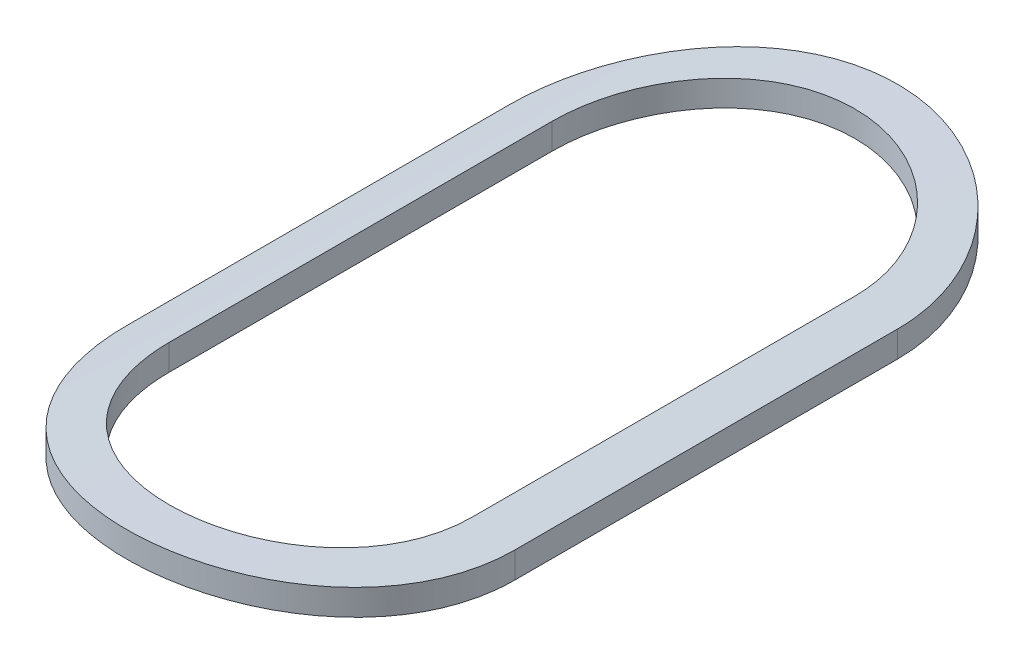
ISO-10303-21;
HEADER;
FILE_DESCRIPTION(('STEP AP214'),'2;1');
FILE_NAME('part.step','',(''),(''),'','','');
FILE_SCHEMA(('AUTOMOTIVE_DESIGN { 1 0 10303 214 1 1 1 1 }'));
ENDSEC;
DATA;
#1=APPLICATION_CONTEXT('core data for automotive mechanical design processes');
#2=APPLICATION_PROTOCOL_DEFINITION('international standard','automotive_design',2000,#1);
#3=PRODUCT_CONTEXT('',#1,'mechanical');
#4=PRODUCT('Part','Part','',(#3));
#5=PRODUCT_RELATED_PRODUCT_CATEGORY('part','',(#4));
#6=PRODUCT_DEFINITION_FORMATION('','',#4);
#7=PRODUCT_DEFINITION_CONTEXT('part definition',#1,'design');
#8=PRODUCT_DEFINITION('design','',#6,#7);
#9=PRODUCT_DEFINITION_SHAPE('','',#8);
#10=(LENGTH_UNIT() NAMED_UNIT(*) SI_UNIT(.MILLI.,.METRE.));
#11=(NAMED_UNIT(*) PLANE_ANGLE_UNIT() SI_UNIT($,.RADIAN.));
#12=(NAMED_UNIT(*) SI_UNIT($,.STERADIAN.) SOLID_ANGLE_UNIT());
#13=UNCERTAINTY_MEASURE_WITH_UNIT(LENGTH_MEASURE(1.E-05),#10,'distance_accuracy_value','');
#14=(GEOMETRIC_REPRESENTATION_CONTEXT(3) GLOBAL_UNCERTAINTY_ASSIGNED_CONTEXT((#13)) GLOBAL_UNIT_ASSIGNED_CONTEXT((#10,
#11,#12)) REPRESENTATION_CONTEXT('',''));
#15=CARTESIAN_POINT('',(0.,0.,0.));
#16=DIRECTION('',(0.,0.,1.));
#17=DIRECTION('',(1.,0.,0.));
#18=AXIS2_PLACEMENT_3D('',#15,#16,#17);
#19=CARTESIAN_POINT('',(-175.2707109821,-62.9180736437962,1.42682282483733));
#20=DIRECTION('',(0.,0.,1.));
#21=DIRECTION('',(1.,0.,0.));
#22=AXIS2_PLACEMENT_3D('',#19,#20,#21);
#23=CYLINDRICAL_SURFACE('',#22,5.);
#24=CARTESIAN_POINT('',(-174.562352977331,-57.9685050830951,5.32081992476383));
#25=CARTESIAN_POINT('',(-174.56231819202,-57.9685236249811,5.36045875118211));
#26=CARTESIAN_POINT('',(-174.565677996493,-57.9680294147791,5.40008292658635));
#27=CARTESIAN_POINT('',(-174.578924725972,-57.9661536270468,5.47815846697256));
#28=CARTESIAN_POINT('',(-174.588804133438,-57.9647730715818,5.51661112942715));
#29=CARTESIAN_POINT('',(-174.614832857679,-57.9612616354489,5.59130719884207));
#30=CARTESIAN_POINT('',(-174.630983979941,-57.9591305387334,5.62754996614363));
#31=CARTESIAN_POINT('',(-174.669077247436,-57.9543647067663,5.6968107435006));
#32=CARTESIAN_POINT('',(-174.691019134295,-57.9517299939866,5.72982889734269));
#33=CARTESIAN_POINT('',(-174.740238549183,-57.9462315808067,5.79193570801099));
#34=CARTESIAN_POINT('',(-174.767548783778,-57.9433665437921,5.82099833037868));
#35=CARTESIAN_POINT('',(-174.826661618482,-57.9377423080896,5.87414733717646));
#36=CARTESIAN_POINT('',(-174.85846490313,-57.9349831256107,5.89823296195574));
#37=CARTESIAN_POINT('',(-174.925826905015,-57.9298676599313,5.94083672096562));
#38=CARTESIAN_POINT('',(-174.961401017461,-57.9275131399999,5.95933074329454));
#39=CARTESIAN_POINT('',(-175.035187231282,-57.9234873673329,5.99007073367095));
#40=CARTESIAN_POINT('',(-175.073399053675,-57.9218160424669,6.0023173613399));
#41=CARTESIAN_POINT('',(-175.151106693764,-57.9193542972137,6.02013689817473));
#42=CARTESIAN_POINT('',(-175.190592212742,-57.9185580590577,6.02575390124891));
#43=CARTESIAN_POINT('',(-175.269953800404,-57.9179162798542,6.03029159454107));
#44=CARTESIAN_POINT('',(-175.309829858972,-57.9180707142472,6.0292124577464));
#45=CARTESIAN_POINT('',(-175.388537942688,-57.9193082454885,6.02042324927953));
#46=CARTESIAN_POINT('',(-175.427375404778,-57.9203846735061,6.01276079389282));
#47=CARTESIAN_POINT('',(-175.503207413134,-57.9233377917456,5.9910971297904));
#48=CARTESIAN_POINT('',(-175.540201926849,-57.9252144960958,5.97709580916644));
#49=CARTESIAN_POINT('',(-175.611444068649,-57.9295688237723,5.94310217437232));
#50=CARTESIAN_POINT('',(-175.64568185491,-57.9320484831862,5.92308950574412));
#51=CARTESIAN_POINT('',(-175.710329754601,-57.9373318406017,5.87765687959288));
#52=CARTESIAN_POINT('',(-175.740739797455,-57.940135544576,5.85223682239281));
#53=CARTESIAN_POINT('',(-175.797147093776,-57.9457827135758,5.79644921190762));
#54=CARTESIAN_POINT('',(-175.823103896636,-57.9486263127461,5.76604076055394));
#55=CARTESIAN_POINT('',(-175.86955966979,-57.9540098748137,5.70126671262856));
#56=CARTESIAN_POINT('',(-175.890057044511,-57.956549748825,5.66689996339814));
#57=CARTESIAN_POINT('',(-175.925016265224,-57.9610385580672,5.59514016548326));
#58=CARTESIAN_POINT('',(-175.939470709579,-57.9629867678087,5.55774347210164));
#59=CARTESIAN_POINT('',(-175.961861656507,-57.9660598482316,5.48104617640926));
#60=CARTESIAN_POINT('',(-175.969807944731,-57.9671859547476,5.4417485269542));
#61=CARTESIAN_POINT('',(-175.975949994197,-57.9680595995502,5.38860509983583));
#62=CARTESIAN_POINT('',(-175.977120148638,-57.9682265264067,5.37506300564641));
#63=CARTESIAN_POINT('',(-175.978678608053,-57.9684491444339,5.34795585093716));
#64=CARTESIAN_POINT('',(-175.979068226181,-57.9685050224289,5.33439086748172));
#65=CARTESIAN_POINT('',(-175.979068986851,-57.9685050830926,5.32081992476383));
#66=B_SPLINE_CURVE_WITH_KNOTS('',3,(#24,#25,#26,#27,#28,#29,#30,#31,#32,#33,#34,#35,#36,#37,#38,
#39,#40,#41,#42,#43,#44,#45,#46,#47,#48,#49,#50,#51,#52,#53,#54,#55,#56,#57,#58,#59,#60,#61,#62,
#63,#64,#65),.UNSPECIFIED.,.F.,.F.,(4,2,2,2,2,2,2,2,2,2,2,2,2,2,2,2,2,2,2,2,4),(0.,
0.118749475652929,0.237362263855814,0.35600922337358,0.474650889962778,0.594039129072952,
0.713445577251891,0.833359813547281,0.953261386262471,1.07236091244366,1.19145736183339,
1.30969958496656,1.42794389566529,1.54659318409006,1.66524465982466,1.78492258189405,
1.90463544277968,2.02449450646763,2.14417301772139,2.18493687446289,2.22563209338629),.UNSPECIFIED.);
#67=CARTESIAN_POINT('',(-174.562352977331,-57.9685050830952,5.32081992476383));
#68=VERTEX_POINT('',#67);
#69=CARTESIAN_POINT('',(-175.97906898685,-57.9685050830925,5.32081992476383));
#70=VERTEX_POINT('',#69);
#71=EDGE_CURVE('E173',#68,#70,#66,.T.);
#72=ORIENTED_EDGE('',*,*,#71,.T.);
#73=DIRECTION('',(0.,0.,-1.));
#74=VECTOR('',#73,1.);
#75=CARTESIAN_POINT('',(-175.97906898685,-57.9685050830925,3.52987704480571));
#76=LINE('',#75,#74);
#77=CARTESIAN_POINT('',(-175.97906898685,-57.9685050830925,3.52987704480571));
#78=VERTEX_POINT('',#77);
#79=EDGE_CURVE('E111',#78,#70,#76,.F.);
#80=ORIENTED_EDGE('',*,*,#79,.F.);
#81=CARTESIAN_POINT('',(-175.979068986851,-57.9685050830926,3.52987704480571));
#82=CARTESIAN_POINT('',(-175.979103777404,-57.9685236247256,3.49023832453203));
#83=CARTESIAN_POINT('',(-175.975743988307,-57.9680294172962,3.45061425502311));
#84=CARTESIAN_POINT('',(-175.962497288361,-57.9661536344881,3.37253870868179));
#85=CARTESIAN_POINT('',(-175.952617860228,-57.9647730764401,3.33408594039167));
#86=CARTESIAN_POINT('',(-175.926588842244,-57.9612615989126,3.25938899672188));
#87=CARTESIAN_POINT('',(-175.910437333816,-57.9591304498519,3.22314550106915));
#88=CARTESIAN_POINT('',(-175.872343784117,-57.9543645974187,3.15388484997989));
#89=CARTESIAN_POINT('',(-175.850402241076,-57.9517299373784,3.1208674172773));
#90=CARTESIAN_POINT('',(-175.801186207544,-57.9462318835382,3.05876469671131));
#91=CARTESIAN_POINT('',(-175.773879481096,-57.9433671722798,3.02970507030447));
#92=CARTESIAN_POINT('',(-175.714767073951,-57.9377429193244,2.97655491580578));
#93=CARTESIAN_POINT('',(-175.682959722483,-57.9349834171696,2.95246624128657));
#94=CARTESIAN_POINT('',(-175.61557800544,-57.9298662750012,2.90984890980619));
#95=CARTESIAN_POINT('',(-175.57998670533,-57.9275105763355,2.89134680394253));
#96=CARTESIAN_POINT('',(-175.506189605935,-57.923485599968,2.86061259257313));
#97=CARTESIAN_POINT('',(-175.467986932545,-57.921815517783,2.848373134471));
#98=CARTESIAN_POINT('',(-175.403100424651,-57.9197589158793,2.83349071746206));
#99=CARTESIAN_POINT('',(-175.376831481638,-57.9191299886342,2.82900786755081));
#100=CARTESIAN_POINT('',(-175.323949145474,-57.9182871387536,2.82302143781594));
#101=CARTESIAN_POINT('',(-175.297335748446,-57.9180732207935,2.82151789155697));
#102=CARTESIAN_POINT('',(-175.231136540235,-57.9180742725377,2.82152074713413));
#103=CARTESIAN_POINT('',(-175.191536979936,-57.9185484483598,2.82484680154105));
#104=CARTESIAN_POINT('',(-175.113441958173,-57.9203944948015,2.83806121489374));
#105=CARTESIAN_POINT('',(-175.074947692914,-57.9217673023731,2.84795642327372));
#106=CARTESIAN_POINT('',(-175.000206768985,-57.9252561689578,2.87400886775347));
#107=CARTESIAN_POINT('',(-174.963958442602,-57.9273716685142,2.8901613912734));
#108=CARTESIAN_POINT('',(-174.894692643812,-57.9321116511946,2.92825947150864));
#109=CARTESIAN_POINT('',(-174.861674706968,-57.9347360609899,2.95020419379137));
#110=CARTESIAN_POINT('',(-174.799570750716,-57.9402220719574,2.99942664621899));
#111=CARTESIAN_POINT('',(-174.770510524656,-57.9430850497233,3.02673676787916));
#112=CARTESIAN_POINT('',(-174.717367995549,-57.9487147875814,3.08584760976759));
#113=CARTESIAN_POINT('',(-174.693286163217,-57.9514815385547,3.11764875415212));
#114=CARTESIAN_POINT('',(-174.650681520965,-57.9566194521663,3.1850138370231));
#115=CARTESIAN_POINT('',(-174.632184900153,-57.9589887286847,3.22059447628956));
#116=CARTESIAN_POINT('',(-174.601448246041,-57.9630429435685,3.29439116564335));
#117=CARTESIAN_POINT('',(-174.589204586684,-57.9647282784311,3.33260567373838));
#118=CARTESIAN_POINT('',(-174.574318473495,-57.9668037408559,3.39751872626201));
#119=CARTESIAN_POINT('',(-174.569835226755,-57.9674384398504,3.42380208033444));
#120=CARTESIAN_POINT('',(-174.563852293327,-57.9682904852838,3.47667870746521));
#121=CARTESIAN_POINT('',(-174.562348809687,-57.9685083628436,3.50327154262443));
#122=CARTESIAN_POINT('',(-174.562352977331,-57.9685050830951,3.5298770448057));
#123=B_SPLINE_CURVE_WITH_KNOTS('',3,(#81,#82,#83,#84,#85,#86,#87,#88,#89,#90,#91,#92,#93,#94,
#95,#96,#97,#98,#99,#100,#101,#102,#103,#104,#105,#106,#107,#108,#109,#110,#111,#112,#113,#114,
#115,#116,#117,#118,#119,#120,#121,#122),.UNSPECIFIED.,.F.,.F.,(4,2,2,2,2,2,2,2,2,2,2,2,2,2,2,2,
2,2,2,2,4),(0.,0.118749159033299,0.237362263863262,0.356011680082915,0.474650889915929,
0.594026017222667,0.713445577112572,0.833424074530637,0.953261387365867,1.03306921841364,
1.11287794856634,1.23150381401027,1.35025356129366,1.46891404775443,1.58755744913422,
1.70694043541029,1.82633470440586,1.94628041824212,2.06615649703429,2.14600710616939,
2.22575590036766),.UNSPECIFIED.);
#124=CARTESIAN_POINT('',(-174.562352977331,-57.9685050830952,3.52987704480571));
#125=VERTEX_POINT('',#124);
#126=EDGE_CURVE('E118',#78,#125,#123,.T.);
#127=ORIENTED_EDGE('',*,*,#126,.T.);
#128=DIRECTION('',(0.,0.,1.));
#129=VECTOR('',#128,1.);
#130=CARTESIAN_POINT('',(-174.562352977331,-57.9685050830952,5.32081992476383));
#131=LINE('',#130,#129);
#132=EDGE_CURVE('E115',#68,#125,#131,.F.);
#133=ORIENTED_EDGE('',*,*,#132,.F.);
#134=EDGE_LOOP('',(#72,#80,#127,#133));
#135=FACE_BOUND('',#134,.T.);
#136=DIRECTION('',(0.,0.,-1.));
#137=VECTOR('',#136,1.);
#138=CARTESIAN_POINT('',(-174.362352977331,-58.0012773560523,3.52987696078578));
#139=LINE('',#138,#137);
#140=CARTESIAN_POINT('',(-174.362352977331,-58.0012773560523,3.52987696078578));
#141=VERTEX_POINT('',#140);
#142=CARTESIAN_POINT('',(-174.362352977331,-58.0012773560523,5.32081994286791));
#143=VERTEX_POINT('',#142);
#144=EDGE_CURVE('E98',#141,#143,#139,.F.);
#145=ORIENTED_EDGE('',*,*,#144,.F.);
#146=CARTESIAN_POINT('',(-176.179068986851,-58.0012773560489,3.52987708101368));
#147=CARTESIAN_POINT('',(-176.179114366647,-58.0013080368418,3.4792219297534));
#148=CARTESIAN_POINT('',(-176.174834712648,-58.000495368357,3.42858937675781));
#149=CARTESIAN_POINT('',(-176.157971730428,-57.9974131802428,3.32884240625041));
#150=CARTESIAN_POINT('',(-176.145400169869,-57.995145725333,3.27972594040186));
#151=CARTESIAN_POINT('',(-176.112294829344,-57.9893820577137,3.18432358231991));
#152=CARTESIAN_POINT('',(-176.091759530645,-57.9858856106396,3.138038231948));
#153=CARTESIAN_POINT('',(-176.043341300228,-57.9780690294218,3.04956636986069));
#154=CARTESIAN_POINT('',(-176.015458277593,-57.9737488850862,3.00737990887206));
#155=CARTESIAN_POINT('',(-175.952792460442,-57.9647138412302,2.92782227610408));
#156=CARTESIAN_POINT('',(-175.917941755172,-57.9599953436674,2.89050499879237));
#157=CARTESIAN_POINT('',(-175.842463605392,-57.9507260347656,2.82220174991102));
#158=CARTESIAN_POINT('',(-175.801834045646,-57.9461752855989,2.79121810680912));
#159=CARTESIAN_POINT('',(-175.715588232075,-57.9377147972196,2.73625643735128));
#160=CARTESIAN_POINT('',(-175.669936683177,-57.9338101507921,2.71233300379545));
#161=CARTESIAN_POINT('',(-175.575213179916,-57.9271295165128,2.67254075741945));
#162=CARTESIAN_POINT('',(-175.526145342003,-57.9243521969489,2.65666243536377));
#163=CARTESIAN_POINT('',(-175.4424669164,-57.9209105999476,2.63723571162568));
#164=CARTESIAN_POINT('',(-175.40839653215,-57.9198519863191,2.63135099754461));
#165=CARTESIAN_POINT('',(-175.339792609163,-57.9184331630702,2.62349190486007));
#166=CARTESIAN_POINT('',(-175.30525906848,-57.9180729563864,2.62151754269873));
#167=CARTESIAN_POINT('',(-175.220141009846,-57.9180746499965,2.62152123179757));
#168=CARTESIAN_POINT('',(-175.169539872234,-57.9188489013581,2.62575686441778));
#169=CARTESIAN_POINT('',(-175.069756594041,-57.9218634183327,2.64257956007804));
#170=CARTESIAN_POINT('',(-175.020575948302,-57.9241051734904,2.65517510877496));
#171=CARTESIAN_POINT('',(-174.925099240572,-57.9298035985899,2.68832059626614));
#172=CARTESIAN_POINT('',(-174.878800496785,-57.9332591185302,2.70886300753467));
#173=CARTESIAN_POINT('',(-174.790312394406,-57.9410069772031,2.7572995596663));
#174=CARTESIAN_POINT('',(-174.748122604101,-57.9452992278809,2.7851929270472));
#175=CARTESIAN_POINT('',(-174.668569162746,-57.9543002591481,2.84787293478168));
#176=CARTESIAN_POINT('',(-174.631258464305,-57.9590128033068,2.88272624567159));
#177=CARTESIAN_POINT('',(-174.562978557937,-57.968295362933,2.95819652195916));
#178=CARTESIAN_POINT('',(-174.532010050101,-57.9728653626182,2.99881412281832));
#179=CARTESIAN_POINT('',(-174.477071165942,-57.9813827188733,3.08503574409306));
#180=CARTESIAN_POINT('',(-174.453156151766,-57.9853250434699,3.13067554180307));
#181=CARTESIAN_POINT('',(-174.413364405679,-57.9920847349784,3.22540082224826));
#182=CARTESIAN_POINT('',(-174.397482636797,-57.9949028065798,3.27448412381041));
#183=CARTESIAN_POINT('',(-174.378056703226,-57.998395644865,3.35818881487485));
#184=CARTESIAN_POINT('',(-174.372173997171,-57.9994703023625,3.39226913660031));
#185=CARTESIAN_POINT('',(-174.364321265333,-58.0009136885917,3.46085325862075));
#186=CARTESIAN_POINT('',(-174.36234686283,-58.0012832069578,3.49535654162629));
#187=CARTESIAN_POINT('',(-174.362352977331,-58.0012773560522,3.52987696078577));
#188=B_SPLINE_CURVE_WITH_KNOTS('',3,(#146,#147,#148,#149,#150,#151,#152,#153,#154,#155,#156,
#157,#158,#159,#160,#161,#162,#163,#164,#165,#166,#167,#168,#169,#170,#171,#172,#173,#174,#175,
#176,#177,#178,#179,#180,#181,#182,#183,#184,#185,#186,#187),.UNSPECIFIED.,.F.,.F.,(4,2,2,2,2,2,
2,2,2,2,2,2,2,2,2,2,2,2,2,2,4),(0.,0.151744406498762,0.303273923270082,0.454832351871486,
0.6063926558806,0.759509268653378,0.912682071666717,1.06700998168233,1.22115504971323,
1.32471214644135,1.42826967860242,1.57985264815249,1.73158971640642,1.88318340494268,
2.03476114885404,2.18786728699564,2.34099031685206,2.49528502654272,2.64948287072658,
2.75306909479241,2.85653925190756),.UNSPECIFIED.);
#189=CARTESIAN_POINT('',(-176.17906898685,-58.0012773560488,3.5298770629097));
#190=VERTEX_POINT('',#189);
#191=EDGE_CURVE('E21',#190,#141,#188,.T.);
#192=ORIENTED_EDGE('',*,*,#191,.F.);
#193=DIRECTION('',(0.,0.,1.));
#194=VECTOR('',#193,1.);
#195=CARTESIAN_POINT('',(-176.17906898685,-58.0012773560488,5.32082006024206));
#196=LINE('',#195,#194);
#197=CARTESIAN_POINT('',(-176.17906898685,-58.0012773560489,5.32082006024206));
#198=VERTEX_POINT('',#197);
#199=EDGE_CURVE('E85',#198,#190,#196,.F.);
#200=ORIENTED_EDGE('',*,*,#199,.F.);
#201=CARTESIAN_POINT('',(-174.362352977331,-58.0012773560522,5.32081999718015));
#202=CARTESIAN_POINT('',(-174.362307610228,-58.0013080360505,5.37147525422055));
#203=CARTESIAN_POINT('',(-174.366587284845,-58.0004953628914,5.42210791225333));
#204=CARTESIAN_POINT('',(-174.383450306933,-57.9974131663501,5.52185487520521));
#205=CARTESIAN_POINT('',(-174.396021852251,-57.9951457137386,5.57097123447137));
#206=CARTESIAN_POINT('',(-174.42912685624,-57.9893821077238,5.66637254599697));
#207=CARTESIAN_POINT('',(-174.449661692882,-57.9858857416783,5.71265700661743));
#208=CARTESIAN_POINT('',(-174.498079590673,-57.9780691912071,5.80112901604925));
#209=CARTESIAN_POINT('',(-174.525963033067,-57.9737489640427,5.84331635214712));
#210=CARTESIAN_POINT('',(-174.588633036654,-57.9647133472899,5.92287905630114));
#211=CARTESIAN_POINT('',(-174.623488098071,-57.9599943286363,5.96020006542393));
#212=CARTESIAN_POINT('',(-174.698966779969,-57.9507250466619,6.02850188445801));
#213=CARTESIAN_POINT('',(-174.739591286672,-57.9461748094026,6.05948171853836));
#214=CARTESIAN_POINT('',(-174.825812375784,-57.9377170390507,6.11442620809822));
#215=CARTESIAN_POINT('',(-174.87144229385,-57.9338143117028,6.13833935533354));
#216=CARTESIAN_POINT('',(-174.966151942711,-57.9271323998905,6.17813887124257));
#217=CARTESIAN_POINT('',(-175.015231213887,-57.9243530660682,6.19402630702382));
#218=CARTESIAN_POINT('',(-175.114880505209,-57.9202565918597,6.21715621127686));
#219=CARTESIAN_POINT('',(-175.165428418801,-57.9189238293954,6.22449110746085));
#220=CARTESIAN_POINT('',(-175.267055002908,-57.9178168560988,6.23059558530492));
#221=CARTESIAN_POINT('',(-175.318133643187,-57.9180425569635,6.22936565225134));
#222=CARTESIAN_POINT('',(-175.418735850112,-57.9200148838634,6.21844630187917));
#223=CARTESIAN_POINT('',(-175.468270643492,-57.9217435791224,6.2088566131761));
#224=CARTESIAN_POINT('',(-175.565015772011,-57.9265075655432,6.18164755950147));
#225=CARTESIAN_POINT('',(-175.612226042043,-57.9295428932801,6.16402796975671));
#226=CARTESIAN_POINT('',(-175.703274511403,-57.9366092879403,6.1211627525986));
#227=CARTESIAN_POINT('',(-175.74709328936,-57.9406456025222,6.09587677358439));
#228=CARTESIAN_POINT('',(-175.829901605459,-57.9492667840127,6.03842705843372));
#229=CARTESIAN_POINT('',(-175.868890850454,-57.9538516841867,6.0062629051228));
#230=CARTESIAN_POINT('',(-175.9415208449,-57.9631391168093,5.93542411214913));
#231=CARTESIAN_POINT('',(-175.975077241772,-57.9678423940488,5.89666303959368));
#232=CARTESIAN_POINT('',(-176.03523420761,-57.9767749976083,5.81400475123458));
#233=CARTESIAN_POINT('',(-176.061832821042,-57.9810041904932,5.77010609648485));
#234=CARTESIAN_POINT('',(-176.107341494261,-57.9885113367211,5.67830469992557));
#235=CARTESIAN_POINT('',(-176.126235445796,-57.9917872930662,5.63039381905504));
#236=CARTESIAN_POINT('',(-176.155655935524,-57.9969864261021,5.53203705199008));
#237=CARTESIAN_POINT('',(-176.166194958724,-57.9989116207771,5.48159506849547));
#238=CARTESIAN_POINT('',(-176.174624694251,-58.0004580940873,5.41243742288703));
#239=CARTESIAN_POINT('',(-176.176291948775,-58.0007650160899,5.39413886799977));
#240=CARTESIAN_POINT('',(-176.178512665097,-58.0011744553454,5.35750293230471));
#241=CARTESIAN_POINT('',(-176.179067998095,-58.0012773160009,5.33916566879907));
#242=CARTESIAN_POINT('',(-176.179068986851,-58.0012773560489,5.32082006024206));
#243=B_SPLINE_CURVE_WITH_KNOTS('',3,(#201,#202,#203,#204,#205,#206,#207,#208,#209,#210,#211,
#212,#213,#214,#215,#216,#217,#218,#219,#220,#221,#222,#223,#224,#225,#226,#227,#228,#229,#230,
#231,#232,#233,#234,#235,#236,#237,#238,#239,#240,#241,#242),.UNSPECIFIED.,.F.,.F.,(4,2,2,2,2,2,
2,2,2,2,2,2,2,2,2,2,2,2,2,2,4),(0.,0.151744722104373,0.303273924606038,0.454829359511642,
0.606392658633337,0.759525593615995,0.912682076236851,1.06692882079774,1.22115505113774,
1.37369863297175,1.52623357170144,1.67697335211144,1.82771735229264,1.97926898039392,
2.13082980300057,2.28455551072837,2.43832437782105,2.59241310359364,2.74627113391338,
2.80137542981597,2.85638691513428),.UNSPECIFIED.);
#244=EDGE_CURVE('E99',#143,#198,#243,.T.);
#245=ORIENTED_EDGE('',*,*,#244,.F.);
#246=EDGE_LOOP('',(#145,#192,#200,#245));
#247=FACE_BOUND('',#246,.T.);
#248=ADVANCED_FACE('F17',(#135,#247),#23,.T.);
#249=CARTESIAN_POINT('',(-174.362352977331,-67.7980736437962,3.52987696078578));
#250=DIRECTION('',(1.,0.,0.));
#251=DIRECTION('',(0.,0.,-1.));
#252=AXIS2_PLACEMENT_3D('',#249,#250,#251);
#253=PLANE('',#252);
#254=ORIENTED_EDGE('',*,*,#144,.T.);
#255=DIRECTION('',(0.,-1.,0.));
#256=VECTOR('',#255,1.);
#257=CARTESIAN_POINT('',(-174.362352977331,-67.7980736437962,5.32081996097199));
#258=LINE('',#257,#256);
#259=CARTESIAN_POINT('',(-174.362352977331,-58.1233592899298,5.32081994286791));
#260=VERTEX_POINT('',#259);
#261=EDGE_CURVE('E168',#260,#143,#258,.F.);
#262=ORIENTED_EDGE('',*,*,#261,.F.);
#263=DIRECTION('',(0.,0.,1.));
#264=VECTOR('',#263,1.);
#265=CARTESIAN_POINT('',(-174.362352977331,-58.1233592899298,1.42682282483733));
#266=LINE('',#265,#264);
#267=CARTESIAN_POINT('',(-174.362352977331,-58.1233592899298,3.52987696078578));
#268=VERTEX_POINT('',#267);
#269=EDGE_CURVE('E106',#260,#268,#266,.F.);
#270=ORIENTED_EDGE('',*,*,#269,.T.);
#271=DIRECTION('',(0.,-1.,0.));
#272=VECTOR('',#271,1.);
#273=CARTESIAN_POINT('',(-174.362352977331,-67.7980736437962,3.52987696078578));
#274=LINE('',#273,#272);
#275=EDGE_CURVE('E93',#141,#268,#274,.T.);
#276=ORIENTED_EDGE('',*,*,#275,.F.);
#277=EDGE_LOOP('',(#254,#262,#270,#276));
#278=FACE_BOUND('',#277,.T.);
#279=ADVANCED_FACE('F105',(#278),#253,.T.);
#280=CARTESIAN_POINT('',(-175.270710982091,-67.7980736437962,3.52987704480571));
#281=DIRECTION('',(0.,-1.,0.));
#282=DIRECTION('',(0.,0.,-1.));
#283=AXIS2_PLACEMENT_3D('',#280,#281,#282);
#284=CYLINDRICAL_SURFACE('',#283,0.908358004759563);
#285=CARTESIAN_POINT('',(-174.362352977331,-58.1233592899298,3.52987696078578));
#286=CARTESIAN_POINT('',(-174.362307508087,-58.1233907487974,3.47924412640068));
#287=CARTESIAN_POINT('',(-174.366583515268,-58.1225580940019,3.42863437829124));
#288=CARTESIAN_POINT('',(-174.383430778239,-58.1194004113025,3.32893485449523));
#289=CARTESIAN_POINT('',(-174.39598999349,-58.117077549709,3.27984298068724));
#290=CARTESIAN_POINT('',(-174.429060709074,-58.1111735224873,3.18448961629184));
#291=CARTESIAN_POINT('',(-174.449573609082,-58.1075921353965,3.1382286255378));
#292=CARTESIAN_POINT('',(-174.497937169855,-58.0995859896331,3.04980062633276));
#293=CARTESIAN_POINT('',(-174.525788012592,-58.0951612100462,3.0076337194446));
#294=CARTESIAN_POINT('',(-174.588397099989,-58.085904772832,2.92808641460642));
#295=CARTESIAN_POINT('',(-174.623226610255,-58.081069241265,2.89076255178149));
#296=CARTESIAN_POINT('',(-174.698663268815,-58.0715693076407,2.82244092508421));
#297=CARTESIAN_POINT('',(-174.739272529207,-58.0669049689299,2.79144548393738));
#298=CARTESIAN_POINT('',(-174.825497694019,-58.0582304523265,2.73644418305895));
#299=CARTESIAN_POINT('',(-174.871150660687,-58.0542257407744,2.71249555116188));
#300=CARTESIAN_POINT('',(-174.965885663096,-58.0473727183835,2.67265472267089));
#301=CARTESIAN_POINT('',(-175.014963568519,-58.0445230419366,2.65675300657522));
#302=CARTESIAN_POINT('',(-175.098702024609,-58.0409889888468,2.6372824855644));
#303=CARTESIAN_POINT('',(-175.132821344127,-58.0399011389449,2.63138031859177));
#304=CARTESIAN_POINT('',(-175.201525922221,-58.0384431136628,2.62349783933904));
#305=CARTESIAN_POINT('',(-175.236111182314,-58.0380729406222,2.62151753984362));
#306=CARTESIAN_POINT('',(-175.321258456786,-58.0380746710759,2.62152123171921));
#307=CARTESIAN_POINT('',(-175.371836963261,-58.0388672527012,2.62575314236866));
#308=CARTESIAN_POINT('',(-175.471574586083,-58.0419531667419,2.64256036553341));
#309=CARTESIAN_POINT('',(-175.52073221257,-58.0442480187177,2.65514412620079));
#310=CARTESIAN_POINT('',(-175.616162592886,-58.0500815690681,2.68825651545196));
#311=CARTESIAN_POINT('',(-175.662438096026,-58.0536190599888,2.70877743356715));
#312=CARTESIAN_POINT('',(-175.750883909833,-58.0615514085309,2.75716130398915));
#313=CARTESIAN_POINT('',(-175.793054632266,-58.0659461800224,2.78502351882315));
#314=CARTESIAN_POINT('',(-175.872596881583,-58.0751658757116,2.847647790937));
#315=CARTESIAN_POINT('',(-175.909912996327,-58.0799948540251,2.88247963683952));
#316=CARTESIAN_POINT('',(-175.978209099492,-58.089508819769,2.95790747983829));
#317=CARTESIAN_POINT('',(-176.009188374133,-58.0941937909281,2.9985041254072));
#318=CARTESIAN_POINT('',(-176.064165819666,-58.1029294932167,3.0847045836066));
#319=CARTESIAN_POINT('',(-176.08810579871,-58.1069748164038,3.13034606526871));
#320=CARTESIAN_POINT('',(-176.127945548409,-58.1139129101381,3.22508317484431));
#321=CARTESIAN_POINT('',(-176.143850407871,-58.1168064099118,3.27417659407272));
#322=CARTESIAN_POINT('',(-176.16331929116,-58.1203956454695,3.35794018337319));
#323=CARTESIAN_POINT('',(-176.16921906572,-58.1215008065872,3.39206818266413));
#324=CARTESIAN_POINT('',(-176.177094869952,-58.1229852590355,3.46075106999702));
#325=CARTESIAN_POINT('',(-176.179075208483,-58.1233653474631,3.4953054471821));
#326=CARTESIAN_POINT('',(-176.179068986851,-58.1233592899264,3.52987708101368));
#327=B_SPLINE_CURVE_WITH_KNOTS('',3,(#285,#286,#287,#288,#289,#290,#291,#292,#293,#294,#295,
#296,#297,#298,#299,#300,#301,#302,#303,#304,#305,#306,#307,#308,#309,#310,#311,#312,#313,#314,
#315,#316,#317,#318,#319,#320,#321,#322,#323,#324,#325,#326),.UNSPECIFIED.,.F.,.F.,(4,2,2,2,2,2,
2,2,2,2,2,2,2,2,2,2,2,2,2,2,4),(0.,0.151676573539622,0.303133153264475,0.454616398136906,
0.606103399928022,0.759224399951092,0.912401499463676,1.06679024866685,1.22099592648086,
1.32470792044237,1.42842025248846,1.57993547839937,1.73160420066226,1.88312595448825,
2.03463249293714,2.18773973988128,2.34086422326659,2.4952210809186,2.64948005828159,
2.75321740397157,2.85684064181504),.UNSPECIFIED.);
#328=CARTESIAN_POINT('',(-176.17906898685,-58.1233592899262,3.5298770629097));
#329=VERTEX_POINT('',#328);
#330=EDGE_CURVE('E150',#268,#329,#327,.T.);
#331=ORIENTED_EDGE('',*,*,#330,.T.);
#332=DIRECTION('',(0.,1.,0.));
#333=VECTOR('',#332,1.);
#334=CARTESIAN_POINT('',(-176.17906898685,-67.7980736437962,3.52987708101368));
#335=LINE('',#334,#333);
#336=EDGE_CURVE('E95',#190,#329,#335,.F.);
#337=ORIENTED_EDGE('',*,*,#336,.F.);
#338=ORIENTED_EDGE('',*,*,#191,.T.);
#339=ORIENTED_EDGE('',*,*,#275,.T.);
#340=EDGE_LOOP('',(#331,#337,#338,#339));
#341=FACE_BOUND('',#340,.T.);
#342=ADVANCED_FACE('F91',(#341),#284,.T.);
#343=CARTESIAN_POINT('',(-176.17906898685,-67.7980736437962,5.32082006024206));
#344=DIRECTION('',(-1.,0.,0.));
#345=DIRECTION('',(0.,0.,1.));
#346=AXIS2_PLACEMENT_3D('',#343,#344,#345);
#347=PLANE('',#346);
#348=ORIENTED_EDGE('',*,*,#199,.T.);
#349=ORIENTED_EDGE('',*,*,#336,.T.);
#350=DIRECTION('',(0.,0.,1.));
#351=VECTOR('',#350,1.);
#352=CARTESIAN_POINT('',(-176.17906898685,-58.1233592899262,1.42682282483733));
#353=LINE('',#352,#351);
#354=CARTESIAN_POINT('',(-176.17906898685,-58.1233592899263,5.32082006024206));
#355=VERTEX_POINT('',#354);
#356=EDGE_CURVE('E149',#329,#355,#353,.T.);
#357=ORIENTED_EDGE('',*,*,#356,.T.);
#358=DIRECTION('',(0.,-1.,0.));
#359=VECTOR('',#358,1.);
#360=CARTESIAN_POINT('',(-176.179068986851,-67.7980736437962,5.32082006024206));
#361=LINE('',#360,#359);
#362=EDGE_CURVE('E114',#198,#355,#361,.T.);
#363=ORIENTED_EDGE('',*,*,#362,.F.);
#364=EDGE_LOOP('',(#348,#349,#357,#363));
#365=FACE_BOUND('',#364,.T.);
#366=ADVANCED_FACE('F161',(#365),#347,.T.);
#367=CARTESIAN_POINT('',(-175.270710982091,-67.7980736437962,5.32081992476383));
#368=DIRECTION('',(0.,-1.,0.));
#369=DIRECTION('',(0.,0.,-1.));
#370=AXIS2_PLACEMENT_3D('',#367,#368,#369);
#371=CYLINDRICAL_SURFACE('',#370,0.908358004759566);
#372=ORIENTED_EDGE('',*,*,#362,.T.);
#373=CARTESIAN_POINT('',(-176.179068986851,-58.1233592899264,5.32082006024206));
#374=CARTESIAN_POINT('',(-176.179114446603,-58.1233907485787,5.37145299652584));
#375=CARTESIAN_POINT('',(-176.174838422648,-58.1225580897244,5.42206284609024));
#376=CARTESIAN_POINT('',(-176.157991127388,-58.1194003997606,5.52176236342243));
#377=CARTESIAN_POINT('',(-176.145431929868,-58.1170775409422,5.57085413511048));
#378=CARTESIAN_POINT('',(-176.112361553414,-58.1111735772115,5.66620646462158));
#379=CARTESIAN_POINT('',(-176.091849115024,-58.1075922730235,5.7124665726855));
#380=CARTESIAN_POINT('',(-176.043485890323,-58.0995861592083,5.80089472105785));
#381=CARTESIAN_POINT('',(-176.015634633861,-58.0951612955449,5.84306249896089));
#382=CARTESIAN_POINT('',(-175.953021385381,-58.0859042740399,5.92261485798261));
#383=CARTESIAN_POINT('',(-175.918187540088,-58.0810682105351,5.95994244128124));
#384=CARTESIAN_POINT('',(-175.842750357195,-58.0715683041891,6.02826264922905));
#385=CARTESIAN_POINT('',(-175.802146131966,-58.0669044879832,6.05925429746094));
#386=CARTESIAN_POINT('',(-175.715945624996,-58.0582327504514,6.11423845450646));
#387=CARTESIAN_POINT('',(-175.670314238439,-58.0542300021296,6.13817681438689));
#388=CARTESIAN_POINT('',(-175.575593079715,-58.0473756738766,6.17802490185476));
#389=CARTESIAN_POINT('',(-175.526503780488,-58.0445239368788,6.19393572495051));
#390=CARTESIAN_POINT('',(-175.426853922194,-58.0403203967009,6.2171012968647));
#391=CARTESIAN_POINT('',(-175.376316621058,-58.0389518062641,6.22445299598073));
#392=CARTESIAN_POINT('',(-175.274707415901,-58.0378109010495,6.23059371493653));
#393=CARTESIAN_POINT('',(-175.223635544434,-58.0380384896276,6.22938325319188));
#394=CARTESIAN_POINT('',(-175.123074256872,-58.0400512285701,6.21850813391137));
#395=CARTESIAN_POINT('',(-175.073573086522,-58.0418171056946,6.20894808464167));
#396=CARTESIAN_POINT('',(-174.976890364572,-58.0466863774311,6.18181062811057));
#397=CARTESIAN_POINT('',(-174.929708880638,-58.0497898110341,6.16423298712754));
#398=CARTESIAN_POINT('',(-174.838699775617,-58.0570178013663,6.12145904106102));
#399=CARTESIAN_POINT('',(-174.794892373643,-58.0611479683555,6.09622070324803));
#400=CARTESIAN_POINT('',(-174.712096891517,-58.069972323252,6.03887354815862));
#401=CARTESIAN_POINT('',(-174.673109129307,-58.0746665483288,6.00676427800146));
#402=CARTESIAN_POINT('',(-174.600442886401,-58.0841822439289,5.93601484990814));
#403=CARTESIAN_POINT('',(-174.56685279796,-58.0890045669733,5.89728396975272));
#404=CARTESIAN_POINT('',(-174.506622797726,-58.0981669479775,5.81467850320751));
#405=CARTESIAN_POINT('',(-174.47998483229,-58.1025068706867,5.77080248132572));
#406=CARTESIAN_POINT('',(-174.43439002292,-58.1102149499786,5.6790296623754));
#407=CARTESIAN_POINT('',(-174.415450324213,-58.1135809326986,5.63112417413817));
#408=CARTESIAN_POINT('',(-174.385939598495,-58.118927019594,5.53276616585795));
#409=CARTESIAN_POINT('',(-174.375356090718,-58.1209091901097,5.48231756455924));
#410=CARTESIAN_POINT('',(-174.366855256612,-58.1225082290762,5.41303171384231));
#411=CARTESIAN_POINT('',(-174.365166263151,-58.1228270554447,5.39461508219227));
#412=CARTESIAN_POINT('',(-174.362916563611,-58.1232523920094,5.35774168608382));
#413=CARTESIAN_POINT('',(-174.362353963208,-58.1233592586682,5.33928504135201));
#414=CARTESIAN_POINT('',(-174.362352977331,-58.1233592899297,5.32081996097199));
#415=B_SPLINE_CURVE_WITH_KNOTS('',3,(#373,#374,#375,#376,#377,#378,#379,#380,#381,#382,#383,
#384,#385,#386,#387,#388,#389,#390,#391,#392,#393,#394,#395,#396,#397,#398,#399,#400,#401,#402,
#403,#404,#405,#406,#407,#408,#409,#410,#411,#412,#413,#414),.UNSPECIFIED.,.F.,.F.,(4,2,2,2,2,2,
2,2,2,2,2,2,2,2,2,2,2,2,2,2,4),(0.,0.151676877592136,0.303133153923813,0.454613424287327,
0.606103401348565,0.759240660666681,0.912401501877929,1.0667092457615,1.22099592575242,
1.37351743374598,1.52602970705535,1.6766581962706,1.82729107675311,1.97876586646993,
2.13025064335472,2.28400724264753,2.43780684247867,2.5919471251964,2.7458567469353,
2.80131963706077,2.8566891732625),.UNSPECIFIED.);
#416=EDGE_CURVE('E142',#355,#260,#415,.T.);
#417=ORIENTED_EDGE('',*,*,#416,.T.);
#418=ORIENTED_EDGE('',*,*,#261,.T.);
#419=ORIENTED_EDGE('',*,*,#244,.T.);
#420=EDGE_LOOP('',(#372,#417,#418,#419));
#421=FACE_BOUND('',#420,.T.);
#422=ADVANCED_FACE('F155',(#421),#371,.T.);
#423=CARTESIAN_POINT('',(-175.97906898685,-67.7980736437962,3.52987704480571));
#424=DIRECTION('',(1.,0.,0.));
#425=DIRECTION('',(0.,0.,-1.));
#426=AXIS2_PLACEMENT_3D('',#423,#424,#425);
#427=PLANE('',#426);
#428=ORIENTED_EDGE('',*,*,#79,.T.);
#429=DIRECTION('',(0.,-1.,0.));
#430=VECTOR('',#429,1.);
#431=CARTESIAN_POINT('',(-175.979068986851,-67.7980736437962,5.32081992476383));
#432=LINE('',#431,#430);
#433=CARTESIAN_POINT('',(-175.97906898685,-58.0897583126371,5.32081992476383));
#434=VERTEX_POINT('',#433);
#435=EDGE_CURVE('E211',#70,#434,#432,.T.);
#436=ORIENTED_EDGE('',*,*,#435,.T.);
#437=DIRECTION('',(0.,0.,1.));
#438=VECTOR('',#437,1.);
#439=CARTESIAN_POINT('',(-175.97906898685,-58.0897583126371,1.42682282483733));
#440=LINE('',#439,#438);
#441=CARTESIAN_POINT('',(-175.979068986851,-58.0897583126371,3.52987704480571));
#442=VERTEX_POINT('',#441);
#443=EDGE_CURVE('E148',#434,#442,#440,.F.);
#444=ORIENTED_EDGE('',*,*,#443,.T.);
#445=DIRECTION('',(0.,-1.,0.));
#446=VECTOR('',#445,1.);
#447=CARTESIAN_POINT('',(-175.979068986851,-67.7980736437962,3.52987704480571));
#448=LINE('',#447,#446);
#449=EDGE_CURVE('E113',#442,#78,#448,.F.);
#450=ORIENTED_EDGE('',*,*,#449,.T.);
#451=EDGE_LOOP('',(#428,#436,#444,#450));
#452=FACE_BOUND('',#451,.T.);
#453=ADVANCED_FACE('F160',(#452),#427,.T.);
#454=CARTESIAN_POINT('',(-175.270710982091,-67.7980736437962,3.52987704480571));
#455=DIRECTION('',(0.,-1.,0.));
#456=DIRECTION('',(0.,0.,-1.));
#457=AXIS2_PLACEMENT_3D('',#454,#455,#456);
#458=CYLINDRICAL_SURFACE('',#457,0.70835800475956);
#459=ORIENTED_EDGE('',*,*,#126,.F.);
#460=ORIENTED_EDGE('',*,*,#449,.F.);
#461=CARTESIAN_POINT('',(-175.979068986851,-58.0897583126371,3.52987704480571));
#462=CARTESIAN_POINT('',(-175.979103823825,-58.0897773193173,3.49024886650503));
#463=CARTESIAN_POINT('',(-175.975745766002,-58.0892709603473,3.4506355673434));
#464=CARTESIAN_POINT('',(-175.96250652588,-58.0873491673296,3.3725824344956));
#465=CARTESIAN_POINT('',(-175.952632958375,-58.0859347945464,3.33414128569907));
#466=CARTESIAN_POINT('',(-175.926620381989,-58.0823374833879,3.25946748012288));
#467=CARTESIAN_POINT('',(-175.910479511476,-58.0801543166689,3.22323548325043));
#468=CARTESIAN_POINT('',(-175.872411931413,-58.0752722557883,3.15399550402409));
#469=CARTESIAN_POINT('',(-175.850485675471,-58.0725734020641,3.12098726918647));
#470=CARTESIAN_POINT('',(-175.80129648344,-58.0669404371545,3.05888923834964));
#471=CARTESIAN_POINT('',(-175.773999702285,-58.0640049075328,3.02982637827084));
#472=CARTESIAN_POINT('',(-175.714906709256,-58.0582413500368,2.97666730970022));
#473=CARTESIAN_POINT('',(-175.683108828381,-58.0554133625346,2.95257295169994));
#474=CARTESIAN_POINT('',(-175.615736695995,-58.0501681877243,2.90993686663441));
#475=CARTESIAN_POINT('',(-175.580144708091,-58.0477530806858,2.89142291868918));
#476=CARTESIAN_POINT('',(-175.506342176922,-58.0436261621531,2.8606658888038));
#477=CARTESIAN_POINT('',(-175.468134765997,-58.0419135259689,2.84841544940994));
#478=CARTESIAN_POINT('',(-175.403219892086,-58.039803494658,2.83351253016725));
#479=CARTESIAN_POINT('',(-175.376927816787,-58.0391579362253,2.82902153948005));
#480=CARTESIAN_POINT('',(-175.323997946818,-58.0382927919896,2.8230242033503));
#481=CARTESIAN_POINT('',(-175.297360148436,-58.0380732107631,2.82151788997346));
#482=CARTESIAN_POINT('',(-175.231147314035,-58.0380742866823,2.8215207474577));
#483=CARTESIAN_POINT('',(-175.191558590165,-58.0385598569114,2.82484501335418));
#484=CARTESIAN_POINT('',(-175.11348543525,-58.040450274787,2.83805198736789));
#485=CARTESIAN_POINT('',(-175.075002198062,-58.0418560799476,2.84794152687285));
#486=CARTESIAN_POINT('',(-175.000283479024,-58.0454288657017,2.87397803814451));
#487=CARTESIAN_POINT('',(-174.964046296148,-58.0475952617727,2.89012020567842));
#488=CARTESIAN_POINT('',(-174.89480072162,-58.0524495488461,2.92819290906304));
#489=CARTESIAN_POINT('',(-174.861791875744,-58.0551373663256,2.95012262899795));
#490=CARTESIAN_POINT('',(-174.799692901944,-58.0607573211762,2.99931850219571));
#491=CARTESIAN_POINT('',(-174.77062979069,-58.063690940303,3.02661859038462));
#492=CARTESIAN_POINT('',(-174.717478981725,-58.0694603501534,3.08570973872557));
#493=CARTESIAN_POINT('',(-174.693391759981,-58.0722961314968,3.11750122801367));
#494=CARTESIAN_POINT('',(-174.650768658495,-58.0775636929608,3.18485660835763));
#495=CARTESIAN_POINT('',(-174.632260255085,-58.0799934480351,3.22043803920287));
#496=CARTESIAN_POINT('',(-174.60150095167,-58.0841518042748,3.29424027810781));
#497=CARTESIAN_POINT('',(-174.589246403311,-58.0858808141172,3.3324595325135));
#498=CARTESIAN_POINT('',(-174.574340055347,-58.088011130352,3.3974005548139));
#499=CARTESIAN_POINT('',(-174.569848790007,-58.0886629126243,3.42370661294342));
#500=CARTESIAN_POINT('',(-174.563855029352,-58.0895379244293,3.47663017999323));
#501=CARTESIAN_POINT('',(-174.562348764728,-58.0897616944218,3.50324725337825));
#502=CARTESIAN_POINT('',(-174.562352977331,-58.0897583126398,3.52987704480571));
#503=B_SPLINE_CURVE_WITH_KNOTS('',3,(#461,#462,#463,#464,#465,#466,#467,#468,#469,#470,#471,
#472,#473,#474,#475,#476,#477,#478,#479,#480,#481,#482,#483,#484,#485,#486,#487,#488,#489,#490,
#491,#492,#493,#494,#495,#496,#497,#498,#499,#500,#501,#502),.UNSPECIFIED.,.F.,.F.,(4,2,2,2,2,2,
2,2,2,2,2,2,2,2,2,2,2,2,2,2,4),(0.,0.118717120276531,0.237295738850607,0.355909606852813,
0.474514177602852,0.593891627580063,0.713313459053385,0.833320307373972,0.953185863457995,
1.03306677770102,1.11294855013568,1.23154197581426,1.35025899575977,1.46888497935199,
1.5874942482517,1.70687857869057,1.82627432356595,1.94624884332564,2.06615329248639,
2.14607569142829,2.22589710390241),.UNSPECIFIED.);
#504=CARTESIAN_POINT('',(-174.562352977331,-58.0897583126398,3.52987704480571));
#505=VERTEX_POINT('',#504);
#506=EDGE_CURVE('E125',#442,#505,#503,.T.);
#507=ORIENTED_EDGE('',*,*,#506,.T.);
#508=DIRECTION('',(0.,1.,0.));
#509=VECTOR('',#508,1.);
#510=CARTESIAN_POINT('',(-174.562352977331,-67.7980736437962,3.52987704480571));
#511=LINE('',#510,#509);
#512=EDGE_CURVE('E117',#125,#505,#511,.F.);
#513=ORIENTED_EDGE('',*,*,#512,.F.);
#514=EDGE_LOOP('',(#459,#460,#507,#513));
#515=FACE_BOUND('',#514,.T.);
#516=ADVANCED_FACE('F177',(#515),#458,.F.);
#517=CARTESIAN_POINT('',(-174.562352977331,-67.7980736437962,5.32081992476383));
#518=DIRECTION('',(-1.,0.,0.));
#519=DIRECTION('',(0.,0.,1.));
#520=AXIS2_PLACEMENT_3D('',#517,#518,#519);
#521=PLANE('',#520);
#522=ORIENTED_EDGE('',*,*,#132,.T.);
#523=ORIENTED_EDGE('',*,*,#512,.T.);
#524=DIRECTION('',(0.,0.,1.));
#525=VECTOR('',#524,1.);
#526=CARTESIAN_POINT('',(-174.562352977331,-58.0897583126398,1.42682282483733));
#527=LINE('',#526,#525);
#528=CARTESIAN_POINT('',(-174.562352977331,-58.0897583126398,5.32081992476383));
#529=VERTEX_POINT('',#528);
#530=EDGE_CURVE('E31',#505,#529,#527,.T.);
#531=ORIENTED_EDGE('',*,*,#530,.T.);
#532=DIRECTION('',(0.,-1.,0.));
#533=VECTOR('',#532,1.);
#534=CARTESIAN_POINT('',(-174.562352977331,-67.7980736437962,5.32081992476383));
#535=LINE('',#534,#533);
#536=EDGE_CURVE('E39',#529,#68,#535,.F.);
#537=ORIENTED_EDGE('',*,*,#536,.T.);
#538=EDGE_LOOP('',(#522,#523,#531,#537));
#539=FACE_BOUND('',#538,.T.);
#540=ADVANCED_FACE('F180',(#539),#521,.T.);
#541=CARTESIAN_POINT('',(-175.270710982091,-67.7980736437962,5.32081992476383));
#542=DIRECTION('',(0.,-1.,0.));
#543=DIRECTION('',(0.,0.,-1.));
#544=AXIS2_PLACEMENT_3D('',#541,#542,#543);
#545=CYLINDRICAL_SURFACE('',#544,0.708358004759557);
#546=ORIENTED_EDGE('',*,*,#435,.F.);
#547=ORIENTED_EDGE('',*,*,#71,.F.);
#548=ORIENTED_EDGE('',*,*,#536,.F.);
#549=CARTESIAN_POINT('',(-174.562352977331,-58.0897583126398,5.32081992476383));
#550=CARTESIAN_POINT('',(-174.562318145595,-58.0897773195768,5.36044820732112));
#551=CARTESIAN_POINT('',(-174.565676218471,-58.0892709578146,5.40006161049676));
#552=CARTESIAN_POINT('',(-174.578915487503,-58.0873491598382,5.47811473749583));
#553=CARTESIAN_POINT('',(-174.588789034667,-58.0859347896541,5.51655578233954));
#554=CARTESIAN_POINT('',(-174.614801319062,-58.0823375206832,5.5912287184547));
#555=CARTESIAN_POINT('',(-174.63094180509,-58.0801544073935,5.62745998981769));
#556=CARTESIAN_POINT('',(-174.669009104071,-58.0752723674002,5.69670009476103));
#557=CARTESIAN_POINT('',(-174.690935702216,-58.0725734598465,5.72970904790733));
#558=CARTESIAN_POINT('',(-174.740128265924,-58.0669401276528,5.79181115880706));
#559=CARTESIAN_POINT('',(-174.767428546325,-58.0640042649716,5.82087700847218));
#560=CARTESIAN_POINT('',(-174.826521965403,-58.0582407250733,5.8740349324172));
#561=CARTESIAN_POINT('',(-174.858315788992,-58.055413064432,5.89812624709079));
#562=CARTESIAN_POINT('',(-174.925668239175,-58.050169605451,5.94074877359399));
#563=CARTESIAN_POINT('',(-174.961243063664,-58.0477557051998,5.95925464293609));
#564=CARTESIAN_POINT('',(-175.035034715016,-58.0436279722361,5.9900174441469));
#565=CARTESIAN_POINT('',(-175.073251256905,-58.04191406415,6.00227504885022));
#566=CARTESIAN_POINT('',(-175.150958833637,-58.039389467019,6.02011132257631));
#567=CARTESIAN_POINT('',(-175.190439041557,-58.0385725234622,6.02573626165024));
#568=CARTESIAN_POINT('',(-175.269791794184,-58.0379124748554,6.03029117701209));
#569=CARTESIAN_POINT('',(-175.309664327784,-58.0380693423134,6.02922134230272));
#570=CARTESIAN_POINT('',(-175.388352295255,-58.0393342663873,6.02045346824757));
#571=CARTESIAN_POINT('',(-175.427173427452,-58.0404351533805,6.0128053879154));
#572=CARTESIAN_POINT('',(-175.502975148297,-58.0434564145505,5.99117651597761));
#573=CARTESIAN_POINT('',(-175.539955702819,-58.0453768039153,5.97719560700346));
#574=CARTESIAN_POINT('',(-175.611179340295,-58.049833671042,5.94324611676228));
#575=CARTESIAN_POINT('',(-175.645412145253,-58.0523723305684,5.92325627118377));
#576=CARTESIAN_POINT('',(-175.710054903811,-58.0577824317937,5.87787262590443));
#577=CARTESIAN_POINT('',(-175.740464774272,-58.0606538807275,5.85247870870903));
#578=CARTESIAN_POINT('',(-175.79689048327,-58.0664400559017,5.79673310162076));
#579=CARTESIAN_POINT('',(-175.822863881165,-58.0693549382954,5.76633845638477));
#580=CARTESIAN_POINT('',(-175.869355359518,-58.0748748078814,5.70158819558162));
#581=CARTESIAN_POINT('',(-175.889871850744,-58.0774797046738,5.66723143028112));
#582=CARTESIAN_POINT('',(-175.92487201698,-58.0820849560916,5.59548457151762));
#583=CARTESIAN_POINT('',(-175.939347968522,-58.0840845358644,5.55809066724752));
#584=CARTESIAN_POINT('',(-175.961781415035,-58.0872401588695,5.48139337006174));
#585=CARTESIAN_POINT('',(-175.969748690355,-58.0883974674652,5.44209293651817));
#586=CARTESIAN_POINT('',(-175.975923787225,-58.0892978114265,5.38888866357366));
#587=CARTESIAN_POINT('',(-175.977103768341,-58.0894703629771,5.37529017740839));
#588=CARTESIAN_POINT('',(-175.978675324785,-58.0897004871399,5.34806971736499));
#589=CARTESIAN_POINT('',(-175.979068224747,-58.0897582529317,5.33444782163047));
#590=CARTESIAN_POINT('',(-175.979068986851,-58.0897583126371,5.32081992476383));
#591=B_SPLINE_CURVE_WITH_KNOTS('',3,(#549,#550,#551,#552,#553,#554,#555,#556,#557,#558,#559,
#560,#561,#562,#563,#564,#565,#566,#567,#568,#569,#570,#571,#572,#573,#574,#575,#576,#577,#578,
#579,#580,#581,#582,#583,#584,#585,#586,#587,#588,#589,#590),.UNSPECIFIED.,.F.,.F.,(4,2,2,2,2,2,
2,2,2,2,2,2,2,2,2,2,2,2,2,2,4),(0.,0.118717431269383,0.237295738842992,0.355907159656546,
0.47451417765182,0.593904709750036,0.71331345919778,0.83325612002505,0.953185862284514,
1.07227391925402,1.19135861421859,1.30954681700373,1.427737210302,1.54635087836981,
1.66496712558317,1.78466126314277,1.9043902215225,2.02427180038247,2.14397290448845,
2.18490777514705,2.22577369557208),.UNSPECIFIED.);
#592=EDGE_CURVE('E11',#529,#434,#591,.T.);
#593=ORIENTED_EDGE('',*,*,#592,.T.);
#594=EDGE_LOOP('',(#546,#547,#548,#593));
#595=FACE_BOUND('',#594,.T.);
#596=ADVANCED_FACE('F131',(#595),#545,.F.);
#597=CARTESIAN_POINT('',(-175.2707109821,-62.9180736437962,1.42682282483733));
#598=DIRECTION('',(0.,0.,1.));
#599=DIRECTION('',(1.,0.,0.));
#600=AXIS2_PLACEMENT_3D('',#597,#598,#599);
#601=CYLINDRICAL_SURFACE('',#600,4.88);
#602=ORIENTED_EDGE('',*,*,#530,.F.);
#603=ORIENTED_EDGE('',*,*,#506,.F.);
#604=ORIENTED_EDGE('',*,*,#443,.F.);
#605=ORIENTED_EDGE('',*,*,#592,.F.);
#606=EDGE_LOOP('',(#602,#603,#604,#605));
#607=FACE_BOUND('',#606,.T.);
#608=ORIENTED_EDGE('',*,*,#356,.F.);
#609=ORIENTED_EDGE('',*,*,#330,.F.);
#610=ORIENTED_EDGE('',*,*,#269,.F.);
#611=ORIENTED_EDGE('',*,*,#416,.F.);
#612=EDGE_LOOP('',(#608,#609,#610,#611));
#613=FACE_BOUND('',#612,.T.);
#614=ADVANCED_FACE('F134',(#607,#613),#601,.F.);
#615=CLOSED_SHELL('',(#248,#279,#342,#366,#422,#453,#516,#540,#596,#614));
#616=MANIFOLD_SOLID_BREP('B1',#615);
#617=ADVANCED_BREP_SHAPE_REPRESENTATION('',(#18,#616),#14);
#618=SHAPE_DEFINITION_REPRESENTATION(#9,#617);
ENDSEC;
END-ISO-10303-21;
